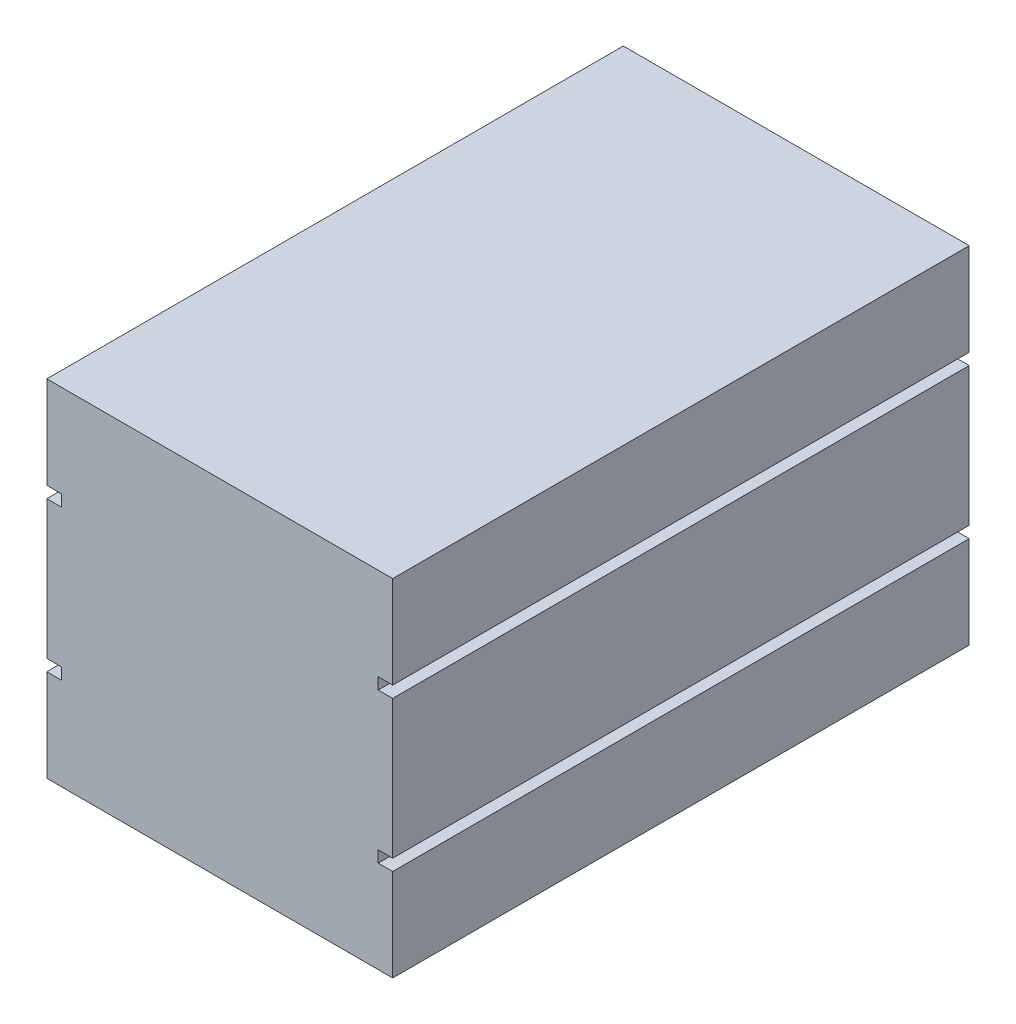
ISO-10303-21;
HEADER;
FILE_DESCRIPTION(('STEP AP214'),'2;1');
FILE_NAME('part.step','',(''),(''),'','','');
FILE_SCHEMA(('AUTOMOTIVE_DESIGN { 1 0 10303 214 1 1 1 1 }'));
ENDSEC;
DATA;
#1=APPLICATION_CONTEXT('core data for automotive mechanical design processes');
#2=APPLICATION_PROTOCOL_DEFINITION('international standard','automotive_design',2000,#1);
#3=PRODUCT_CONTEXT('',#1,'mechanical');
#4=PRODUCT('Part','Part','',(#3));
#5=PRODUCT_RELATED_PRODUCT_CATEGORY('part','',(#4));
#6=PRODUCT_DEFINITION_FORMATION('','',#4);
#7=PRODUCT_DEFINITION_CONTEXT('part definition',#1,'design');
#8=PRODUCT_DEFINITION('design','',#6,#7);
#9=PRODUCT_DEFINITION_SHAPE('','',#8);
#10=(LENGTH_UNIT() NAMED_UNIT(*) SI_UNIT(.MILLI.,.METRE.));
#11=(NAMED_UNIT(*) PLANE_ANGLE_UNIT() SI_UNIT($,.RADIAN.));
#12=(NAMED_UNIT(*) SI_UNIT($,.STERADIAN.) SOLID_ANGLE_UNIT());
#13=UNCERTAINTY_MEASURE_WITH_UNIT(LENGTH_MEASURE(1.E-05),#10,'distance_accuracy_value','');
#14=(GEOMETRIC_REPRESENTATION_CONTEXT(3) GLOBAL_UNCERTAINTY_ASSIGNED_CONTEXT((#13)) GLOBAL_UNIT_ASSIGNED_CONTEXT((#10,
#11,#12)) REPRESENTATION_CONTEXT('',''));
#15=CARTESIAN_POINT('',(0.,0.,0.));
#16=DIRECTION('',(0.,0.,1.));
#17=DIRECTION('',(1.,0.,0.));
#18=AXIS2_PLACEMENT_3D('',#15,#16,#17);
#19=CARTESIAN_POINT('',(0.,0.,0.));
#20=DIRECTION('',(-1.,0.,0.));
#21=DIRECTION('',(0.,0.,1.));
#22=AXIS2_PLACEMENT_3D('',#19,#20,#21);
#23=PLANE('',#22);
#24=DIRECTION('',(0.,0.,-1.));
#25=VECTOR('',#24,1.);
#26=CARTESIAN_POINT('',(0.,7.,25.));
#27=LINE('',#26,#25);
#28=CARTESIAN_POINT('',(0.,7.,25.));
#29=VERTEX_POINT('',#28);
#30=CARTESIAN_POINT('',(0.,7.,-25.));
#31=VERTEX_POINT('',#30);
#32=EDGE_CURVE('E200',#29,#31,#27,.T.);
#33=ORIENTED_EDGE('',*,*,#32,.F.);
#34=DIRECTION('',(0.,-1.,0.));
#35=VECTOR('',#34,1.);
#36=CARTESIAN_POINT('',(0.,-15.,25.));
#37=LINE('',#36,#35);
#38=CARTESIAN_POINT('',(0.,15.,25.));
#39=VERTEX_POINT('',#38);
#40=EDGE_CURVE('E191',#39,#29,#37,.T.);
#41=ORIENTED_EDGE('',*,*,#40,.F.);
#42=DIRECTION('',(0.,0.,1.));
#43=VECTOR('',#42,1.);
#44=CARTESIAN_POINT('',(0.,15.,25.));
#45=LINE('',#44,#43);
#46=CARTESIAN_POINT('',(0.,15.,-25.));
#47=VERTEX_POINT('',#46);
#48=EDGE_CURVE('E308',#47,#39,#45,.T.);
#49=ORIENTED_EDGE('',*,*,#48,.F.);
#50=DIRECTION('',(0.,1.,0.));
#51=VECTOR('',#50,1.);
#52=CARTESIAN_POINT('',(0.,-15.,-25.));
#53=LINE('',#52,#51);
#54=EDGE_CURVE('E287',#31,#47,#53,.T.);
#55=ORIENTED_EDGE('',*,*,#54,.F.);
#56=EDGE_LOOP('',(#33,#41,#49,#55));
#57=FACE_BOUND('',#56,.T.);
#58=ADVANCED_FACE('F33',(#57),#23,.T.);
#59=DIRECTION('',(0.,0.,-1.));
#60=VECTOR('',#59,1.);
#61=CARTESIAN_POINT('',(0.,6.,25.));
#62=LINE('',#61,#60);
#63=CARTESIAN_POINT('',(0.,6.,25.));
#64=VERTEX_POINT('',#63);
#65=CARTESIAN_POINT('',(0.,6.,-25.));
#66=VERTEX_POINT('',#65);
#67=EDGE_CURVE('E203',#64,#66,#62,.T.);
#68=ORIENTED_EDGE('',*,*,#67,.T.);
#69=CARTESIAN_POINT('',(0.,-6.,-25.));
#70=VERTEX_POINT('',#69);
#71=EDGE_CURVE('E309',#70,#66,#53,.T.);
#72=ORIENTED_EDGE('',*,*,#71,.F.);
#73=DIRECTION('',(0.,0.,-1.));
#74=VECTOR('',#73,1.);
#75=CARTESIAN_POINT('',(0.,-6.,25.));
#76=LINE('',#75,#74);
#77=CARTESIAN_POINT('',(0.,-6.,25.));
#78=VERTEX_POINT('',#77);
#79=EDGE_CURVE('E223',#78,#70,#76,.T.);
#80=ORIENTED_EDGE('',*,*,#79,.F.);
#81=EDGE_CURVE('E314',#64,#78,#37,.T.);
#82=ORIENTED_EDGE('',*,*,#81,.F.);
#83=EDGE_LOOP('',(#68,#72,#80,#82));
#84=FACE_BOUND('',#83,.T.);
#85=ADVANCED_FACE('F336',(#84),#23,.T.);
#86=CARTESIAN_POINT('',(30.,0.,0.));
#87=DIRECTION('',(-1.,0.,0.));
#88=DIRECTION('',(0.,0.,1.));
#89=AXIS2_PLACEMENT_3D('',#86,#87,#88);
#90=PLANE('',#89);
#91=DIRECTION('',(0.,-1.,0.));
#92=VECTOR('',#91,1.);
#93=CARTESIAN_POINT('',(30.,-15.,25.));
#94=LINE('',#93,#92);
#95=CARTESIAN_POINT('',(30.,6.,25.));
#96=VERTEX_POINT('',#95);
#97=CARTESIAN_POINT('',(30.,-6.,25.));
#98=VERTEX_POINT('',#97);
#99=EDGE_CURVE('E302',#96,#98,#94,.T.);
#100=ORIENTED_EDGE('',*,*,#99,.T.);
#101=DIRECTION('',(0.,0.,-1.));
#102=VECTOR('',#101,1.);
#103=CARTESIAN_POINT('',(30.,-6.,25.));
#104=LINE('',#103,#102);
#105=CARTESIAN_POINT('',(30.,-6.,-25.));
#106=VERTEX_POINT('',#105);
#107=EDGE_CURVE('E248',#98,#106,#104,.T.);
#108=ORIENTED_EDGE('',*,*,#107,.T.);
#109=DIRECTION('',(0.,1.,0.));
#110=VECTOR('',#109,1.);
#111=CARTESIAN_POINT('',(30.,-15.,-25.));
#112=LINE('',#111,#110);
#113=CARTESIAN_POINT('',(30.,6.,-25.));
#114=VERTEX_POINT('',#113);
#115=EDGE_CURVE('E294',#106,#114,#112,.T.);
#116=ORIENTED_EDGE('',*,*,#115,.T.);
#117=DIRECTION('',(0.,0.,-1.));
#118=VECTOR('',#117,1.);
#119=CARTESIAN_POINT('',(30.,6.,25.));
#120=LINE('',#119,#118);
#121=EDGE_CURVE('E267',#96,#114,#120,.T.);
#122=ORIENTED_EDGE('',*,*,#121,.F.);
#123=EDGE_LOOP('',(#100,#108,#116,#122));
#124=FACE_BOUND('',#123,.T.);
#125=ADVANCED_FACE('F362',(#124),#90,.F.);
#126=CARTESIAN_POINT('',(30.,15.,25.));
#127=VERTEX_POINT('',#126);
#128=CARTESIAN_POINT('',(30.,7.,25.));
#129=VERTEX_POINT('',#128);
#130=EDGE_CURVE('E298',#127,#129,#94,.T.);
#131=ORIENTED_EDGE('',*,*,#130,.T.);
#132=DIRECTION('',(0.,0.,-1.));
#133=VECTOR('',#132,1.);
#134=CARTESIAN_POINT('',(30.,7.,25.));
#135=LINE('',#134,#133);
#136=CARTESIAN_POINT('',(30.,7.,-25.));
#137=VERTEX_POINT('',#136);
#138=EDGE_CURVE('E274',#129,#137,#135,.T.);
#139=ORIENTED_EDGE('',*,*,#138,.T.);
#140=CARTESIAN_POINT('',(30.,15.,-25.));
#141=VERTEX_POINT('',#140);
#142=EDGE_CURVE('E295',#137,#141,#112,.T.);
#143=ORIENTED_EDGE('',*,*,#142,.T.);
#144=DIRECTION('',(0.,0.,1.));
#145=VECTOR('',#144,1.);
#146=CARTESIAN_POINT('',(30.,15.,25.));
#147=LINE('',#146,#145);
#148=EDGE_CURVE('E293',#141,#127,#147,.T.);
#149=ORIENTED_EDGE('',*,*,#148,.T.);
#150=EDGE_LOOP('',(#131,#139,#143,#149));
#151=FACE_BOUND('',#150,.T.);
#152=ADVANCED_FACE('F373',(#151),#90,.F.);
#153=CARTESIAN_POINT('',(30.,-15.,-25.));
#154=DIRECTION('',(0.,0.,1.));
#155=DIRECTION('',(1.,0.,0.));
#156=AXIS2_PLACEMENT_3D('',#153,#154,#155);
#157=PLANE('',#156);
#158=CARTESIAN_POINT('',(15.,0.,-25.));
#159=DIRECTION('',(0.,0.,-1.));
#160=DIRECTION('',(-1.,0.,0.));
#161=AXIS2_PLACEMENT_3D('',#158,#159,#160);
#162=CIRCLE('',#161,5.93334200487304);
#163=CARTESIAN_POINT('',(9.06665799512696,0.,-25.));
#164=VERTEX_POINT('',#163);
#165=EDGE_CURVE('E277',#164,#164,#162,.T.);
#166=ORIENTED_EDGE('',*,*,#165,.F.);
#167=EDGE_LOOP('',(#166));
#168=FACE_BOUND('',#167,.T.);
#169=DIRECTION('',(0.,-1.,0.));
#170=VECTOR('',#169,1.);
#171=CARTESIAN_POINT('',(1.25496537556247,7.,-25.));
#172=LINE('',#171,#170);
#173=CARTESIAN_POINT('',(1.25496537556247,7.,-25.));
#174=VERTEX_POINT('',#173);
#175=CARTESIAN_POINT('',(1.25496537556247,6.,-25.));
#176=VERTEX_POINT('',#175);
#177=EDGE_CURVE('E194',#174,#176,#172,.T.);
#178=ORIENTED_EDGE('',*,*,#177,.F.);
#179=DIRECTION('',(1.,0.,0.));
#180=VECTOR('',#179,1.);
#181=CARTESIAN_POINT('',(0.,7.,-25.));
#182=LINE('',#181,#180);
#183=EDGE_CURVE('E176',#31,#174,#182,.T.);
#184=ORIENTED_EDGE('',*,*,#183,.F.);
#185=ORIENTED_EDGE('',*,*,#54,.T.);
#186=DIRECTION('',(-1.,0.,0.));
#187=VECTOR('',#186,1.);
#188=CARTESIAN_POINT('',(30.,15.,-25.));
#189=LINE('',#188,#187);
#190=EDGE_CURVE('E11',#141,#47,#189,.T.);
#191=ORIENTED_EDGE('',*,*,#190,.F.);
#192=ORIENTED_EDGE('',*,*,#142,.F.);
#193=DIRECTION('',(1.,0.,0.));
#194=VECTOR('',#193,1.);
#195=CARTESIAN_POINT('',(30.,7.,-25.));
#196=LINE('',#195,#194);
#197=CARTESIAN_POINT('',(28.7450346244375,7.,-25.));
#198=VERTEX_POINT('',#197);
#199=EDGE_CURVE('E261',#198,#137,#196,.T.);
#200=ORIENTED_EDGE('',*,*,#199,.F.);
#201=DIRECTION('',(0.,1.,0.));
#202=VECTOR('',#201,1.);
#203=CARTESIAN_POINT('',(28.7450346244375,7.,-25.));
#204=LINE('',#203,#202);
#205=CARTESIAN_POINT('',(28.7450346244375,6.,-25.));
#206=VERTEX_POINT('',#205);
#207=EDGE_CURVE('E270',#206,#198,#204,.T.);
#208=ORIENTED_EDGE('',*,*,#207,.F.);
#209=DIRECTION('',(-1.,0.,0.));
#210=VECTOR('',#209,1.);
#211=CARTESIAN_POINT('',(30.,6.,-25.));
#212=LINE('',#211,#210);
#213=EDGE_CURVE('E251',#114,#206,#212,.T.);
#214=ORIENTED_EDGE('',*,*,#213,.F.);
#215=ORIENTED_EDGE('',*,*,#115,.F.);
#216=DIRECTION('',(1.,0.,0.));
#217=VECTOR('',#216,1.);
#218=CARTESIAN_POINT('',(30.,-6.,-25.));
#219=LINE('',#218,#217);
#220=CARTESIAN_POINT('',(28.7450346244375,-6.,-25.));
#221=VERTEX_POINT('',#220);
#222=EDGE_CURVE('E235',#221,#106,#219,.T.);
#223=ORIENTED_EDGE('',*,*,#222,.F.);
#224=DIRECTION('',(0.,1.,0.));
#225=VECTOR('',#224,1.);
#226=CARTESIAN_POINT('',(28.7450346244375,-6.,-25.));
#227=LINE('',#226,#225);
#228=CARTESIAN_POINT('',(28.7450346244375,-7.,-25.));
#229=VERTEX_POINT('',#228);
#230=EDGE_CURVE('E244',#229,#221,#227,.T.);
#231=ORIENTED_EDGE('',*,*,#230,.F.);
#232=DIRECTION('',(-1.,0.,0.));
#233=VECTOR('',#232,1.);
#234=CARTESIAN_POINT('',(30.,-7.,-25.));
#235=LINE('',#234,#233);
#236=CARTESIAN_POINT('',(30.,-7.,-25.));
#237=VERTEX_POINT('',#236);
#238=EDGE_CURVE('E225',#237,#229,#235,.T.);
#239=ORIENTED_EDGE('',*,*,#238,.F.);
#240=CARTESIAN_POINT('',(30.,-15.,-25.));
#241=VERTEX_POINT('',#240);
#242=EDGE_CURVE('E290',#241,#237,#112,.T.);
#243=ORIENTED_EDGE('',*,*,#242,.F.);
#244=DIRECTION('',(-1.,0.,0.));
#245=VECTOR('',#244,1.);
#246=CARTESIAN_POINT('',(30.,-15.,-25.));
#247=LINE('',#246,#245);
#248=CARTESIAN_POINT('',(0.,-15.,-25.));
#249=VERTEX_POINT('',#248);
#250=EDGE_CURVE('E304',#241,#249,#247,.T.);
#251=ORIENTED_EDGE('',*,*,#250,.T.);
#252=CARTESIAN_POINT('',(0.,-7.,-25.));
#253=VERTEX_POINT('',#252);
#254=EDGE_CURVE('E305',#249,#253,#53,.T.);
#255=ORIENTED_EDGE('',*,*,#254,.T.);
#256=DIRECTION('',(-1.,0.,0.));
#257=VECTOR('',#256,1.);
#258=CARTESIAN_POINT('',(0.,-7.,-25.));
#259=LINE('',#258,#257);
#260=CARTESIAN_POINT('',(1.25496537556247,-7.,-25.));
#261=VERTEX_POINT('',#260);
#262=EDGE_CURVE('E56',#261,#253,#259,.T.);
#263=ORIENTED_EDGE('',*,*,#262,.F.);
#264=DIRECTION('',(0.,-1.,0.));
#265=VECTOR('',#264,1.);
#266=CARTESIAN_POINT('',(1.25496537556247,-6.,-25.));
#267=LINE('',#266,#265);
#268=CARTESIAN_POINT('',(1.25496537556247,-6.,-25.));
#269=VERTEX_POINT('',#268);
#270=EDGE_CURVE('E219',#269,#261,#267,.T.);
#271=ORIENTED_EDGE('',*,*,#270,.F.);
#272=DIRECTION('',(1.,0.,0.));
#273=VECTOR('',#272,1.);
#274=CARTESIAN_POINT('',(0.,-6.,-25.));
#275=LINE('',#274,#273);
#276=EDGE_CURVE('E202',#70,#269,#275,.T.);
#277=ORIENTED_EDGE('',*,*,#276,.F.);
#278=ORIENTED_EDGE('',*,*,#71,.T.);
#279=DIRECTION('',(-1.,0.,0.));
#280=VECTOR('',#279,1.);
#281=CARTESIAN_POINT('',(0.,6.,-25.));
#282=LINE('',#281,#280);
#283=EDGE_CURVE('E192',#176,#66,#282,.T.);
#284=ORIENTED_EDGE('',*,*,#283,.F.);
#285=EDGE_LOOP('',(#178,#184,#185,#191,#192,#200,#208,#214,#215,#223,#231,#239,#243,#251,#255,
#263,#271,#277,#278,#284));
#286=FACE_BOUND('',#285,.T.);
#287=ADVANCED_FACE('F35',(#168,#286),#157,.F.);
#288=CARTESIAN_POINT('',(30.,15.,25.));
#289=DIRECTION('',(0.,-1.,0.));
#290=DIRECTION('',(0.,0.,-1.));
#291=AXIS2_PLACEMENT_3D('',#288,#289,#290);
#292=PLANE('',#291);
#293=ORIENTED_EDGE('',*,*,#48,.T.);
#294=DIRECTION('',(-1.,0.,0.));
#295=VECTOR('',#294,1.);
#296=CARTESIAN_POINT('',(30.,15.,25.));
#297=LINE('',#296,#295);
#298=EDGE_CURVE('E41',#127,#39,#297,.T.);
#299=ORIENTED_EDGE('',*,*,#298,.F.);
#300=ORIENTED_EDGE('',*,*,#148,.F.);
#301=ORIENTED_EDGE('',*,*,#190,.T.);
#302=EDGE_LOOP('',(#293,#299,#300,#301));
#303=FACE_BOUND('',#302,.T.);
#304=ADVANCED_FACE('F375',(#303),#292,.F.);
#305=CARTESIAN_POINT('',(30.,-15.,25.));
#306=DIRECTION('',(0.,0.,-1.));
#307=DIRECTION('',(-1.,0.,0.));
#308=AXIS2_PLACEMENT_3D('',#305,#306,#307);
#309=PLANE('',#308);
#310=ORIENTED_EDGE('',*,*,#40,.T.);
#311=DIRECTION('',(1.,0.,0.));
#312=VECTOR('',#311,1.);
#313=CARTESIAN_POINT('',(0.,7.,25.));
#314=LINE('',#313,#312);
#315=CARTESIAN_POINT('',(1.25496537556247,7.,25.));
#316=VERTEX_POINT('',#315);
#317=EDGE_CURVE('E173',#29,#316,#314,.T.);
#318=ORIENTED_EDGE('',*,*,#317,.T.);
#319=DIRECTION('',(0.,-1.,0.));
#320=VECTOR('',#319,1.);
#321=CARTESIAN_POINT('',(1.25496537556247,7.,25.));
#322=LINE('',#321,#320);
#323=CARTESIAN_POINT('',(1.25496537556247,6.,25.));
#324=VERTEX_POINT('',#323);
#325=EDGE_CURVE('E183',#316,#324,#322,.T.);
#326=ORIENTED_EDGE('',*,*,#325,.T.);
#327=DIRECTION('',(-1.,0.,0.));
#328=VECTOR('',#327,1.);
#329=CARTESIAN_POINT('',(0.,6.,25.));
#330=LINE('',#329,#328);
#331=EDGE_CURVE('E48',#324,#64,#330,.T.);
#332=ORIENTED_EDGE('',*,*,#331,.T.);
#333=ORIENTED_EDGE('',*,*,#81,.T.);
#334=DIRECTION('',(1.,0.,0.));
#335=VECTOR('',#334,1.);
#336=CARTESIAN_POINT('',(0.,-6.,25.));
#337=LINE('',#336,#335);
#338=CARTESIAN_POINT('',(1.25496537556247,-6.,25.));
#339=VERTEX_POINT('',#338);
#340=EDGE_CURVE('E207',#78,#339,#337,.T.);
#341=ORIENTED_EDGE('',*,*,#340,.T.);
#342=DIRECTION('',(0.,-1.,0.));
#343=VECTOR('',#342,1.);
#344=CARTESIAN_POINT('',(1.25496537556247,-6.,25.));
#345=LINE('',#344,#343);
#346=CARTESIAN_POINT('',(1.25496537556247,-7.,25.));
#347=VERTEX_POINT('',#346);
#348=EDGE_CURVE('E210',#339,#347,#345,.T.);
#349=ORIENTED_EDGE('',*,*,#348,.T.);
#350=DIRECTION('',(-1.,0.,0.));
#351=VECTOR('',#350,1.);
#352=CARTESIAN_POINT('',(0.,-7.,25.));
#353=LINE('',#352,#351);
#354=CARTESIAN_POINT('',(0.,-7.,25.));
#355=VERTEX_POINT('',#354);
#356=EDGE_CURVE('E213',#347,#355,#353,.T.);
#357=ORIENTED_EDGE('',*,*,#356,.T.);
#358=CARTESIAN_POINT('',(0.,-15.,25.));
#359=VERTEX_POINT('',#358);
#360=EDGE_CURVE('E311',#355,#359,#37,.T.);
#361=ORIENTED_EDGE('',*,*,#360,.T.);
#362=DIRECTION('',(-1.,0.,0.));
#363=VECTOR('',#362,1.);
#364=CARTESIAN_POINT('',(30.,-15.,25.));
#365=LINE('',#364,#363);
#366=CARTESIAN_POINT('',(30.,-15.,25.));
#367=VERTEX_POINT('',#366);
#368=EDGE_CURVE('E318',#367,#359,#365,.T.);
#369=ORIENTED_EDGE('',*,*,#368,.F.);
#370=CARTESIAN_POINT('',(30.,-7.,25.));
#371=VERTEX_POINT('',#370);
#372=EDGE_CURVE('E297',#371,#367,#94,.T.);
#373=ORIENTED_EDGE('',*,*,#372,.F.);
#374=DIRECTION('',(-1.,0.,0.));
#375=VECTOR('',#374,1.);
#376=CARTESIAN_POINT('',(30.,-7.,25.));
#377=LINE('',#376,#375);
#378=CARTESIAN_POINT('',(28.7450346244375,-7.,25.));
#379=VERTEX_POINT('',#378);
#380=EDGE_CURVE('E231',#371,#379,#377,.T.);
#381=ORIENTED_EDGE('',*,*,#380,.T.);
#382=DIRECTION('',(0.,1.,0.));
#383=VECTOR('',#382,1.);
#384=CARTESIAN_POINT('',(28.7450346244375,-6.,25.));
#385=LINE('',#384,#383);
#386=CARTESIAN_POINT('',(28.7450346244375,-6.,25.));
#387=VERTEX_POINT('',#386);
#388=EDGE_CURVE('E234',#379,#387,#385,.T.);
#389=ORIENTED_EDGE('',*,*,#388,.T.);
#390=DIRECTION('',(1.,0.,0.));
#391=VECTOR('',#390,1.);
#392=CARTESIAN_POINT('',(30.,-6.,25.));
#393=LINE('',#392,#391);
#394=EDGE_CURVE('E238',#387,#98,#393,.T.);
#395=ORIENTED_EDGE('',*,*,#394,.T.);
#396=ORIENTED_EDGE('',*,*,#99,.F.);
#397=DIRECTION('',(-1.,0.,0.));
#398=VECTOR('',#397,1.);
#399=CARTESIAN_POINT('',(30.,6.,25.));
#400=LINE('',#399,#398);
#401=CARTESIAN_POINT('',(28.7450346244375,6.,25.));
#402=VERTEX_POINT('',#401);
#403=EDGE_CURVE('E257',#96,#402,#400,.T.);
#404=ORIENTED_EDGE('',*,*,#403,.T.);
#405=DIRECTION('',(0.,1.,0.));
#406=VECTOR('',#405,1.);
#407=CARTESIAN_POINT('',(28.7450346244375,7.,25.));
#408=LINE('',#407,#406);
#409=CARTESIAN_POINT('',(28.7450346244375,7.,25.));
#410=VERTEX_POINT('',#409);
#411=EDGE_CURVE('E260',#402,#410,#408,.T.);
#412=ORIENTED_EDGE('',*,*,#411,.T.);
#413=DIRECTION('',(1.,0.,0.));
#414=VECTOR('',#413,1.);
#415=CARTESIAN_POINT('',(30.,7.,25.));
#416=LINE('',#415,#414);
#417=EDGE_CURVE('E264',#410,#129,#416,.T.);
#418=ORIENTED_EDGE('',*,*,#417,.T.);
#419=ORIENTED_EDGE('',*,*,#130,.F.);
#420=ORIENTED_EDGE('',*,*,#298,.T.);
#421=EDGE_LOOP('',(#310,#318,#326,#332,#333,#341,#349,#357,#361,#369,#373,#381,#389,#395,#396,
#404,#412,#418,#419,#420));
#422=FACE_BOUND('',#421,.T.);
#423=ADVANCED_FACE('F188',(#422),#309,.F.);
#424=CARTESIAN_POINT('',(30.,-15.,25.));
#425=DIRECTION('',(0.,1.,0.));
#426=DIRECTION('',(0.,0.,1.));
#427=AXIS2_PLACEMENT_3D('',#424,#425,#426);
#428=PLANE('',#427);
#429=DIRECTION('',(0.,0.,-1.));
#430=VECTOR('',#429,1.);
#431=CARTESIAN_POINT('',(0.,-15.,25.));
#432=LINE('',#431,#430);
#433=EDGE_CURVE('E313',#359,#249,#432,.T.);
#434=ORIENTED_EDGE('',*,*,#433,.T.);
#435=ORIENTED_EDGE('',*,*,#250,.F.);
#436=DIRECTION('',(0.,0.,-1.));
#437=VECTOR('',#436,1.);
#438=CARTESIAN_POINT('',(30.,-15.,25.));
#439=LINE('',#438,#437);
#440=EDGE_CURVE('E301',#367,#241,#439,.T.);
#441=ORIENTED_EDGE('',*,*,#440,.F.);
#442=ORIENTED_EDGE('',*,*,#368,.T.);
#443=EDGE_LOOP('',(#434,#435,#441,#442));
#444=FACE_BOUND('',#443,.T.);
#445=ADVANCED_FACE('F347',(#444),#428,.F.);
#446=ORIENTED_EDGE('',*,*,#242,.T.);
#447=DIRECTION('',(0.,0.,-1.));
#448=VECTOR('',#447,1.);
#449=CARTESIAN_POINT('',(30.,-7.,25.));
#450=LINE('',#449,#448);
#451=EDGE_CURVE('E241',#371,#237,#450,.T.);
#452=ORIENTED_EDGE('',*,*,#451,.F.);
#453=ORIENTED_EDGE('',*,*,#372,.T.);
#454=ORIENTED_EDGE('',*,*,#440,.T.);
#455=EDGE_LOOP('',(#446,#452,#453,#454));
#456=FACE_BOUND('',#455,.T.);
#457=ADVANCED_FACE('F357',(#456),#90,.F.);
#458=DIRECTION('',(0.,0.,-1.));
#459=VECTOR('',#458,1.);
#460=CARTESIAN_POINT('',(0.,-7.,25.));
#461=LINE('',#460,#459);
#462=EDGE_CURVE('E226',#355,#253,#461,.T.);
#463=ORIENTED_EDGE('',*,*,#462,.T.);
#464=ORIENTED_EDGE('',*,*,#254,.F.);
#465=ORIENTED_EDGE('',*,*,#433,.F.);
#466=ORIENTED_EDGE('',*,*,#360,.F.);
#467=EDGE_LOOP('',(#463,#464,#465,#466));
#468=FACE_BOUND('',#467,.T.);
#469=ADVANCED_FACE('F350',(#468),#23,.T.);
#470=CARTESIAN_POINT('',(15.,0.,15.));
#471=DIRECTION('',(0.,0.,-1.));
#472=DIRECTION('',(-1.,0.,0.));
#473=AXIS2_PLACEMENT_3D('',#470,#471,#472);
#474=CYLINDRICAL_SURFACE('',#473,5.93334200487304);
#475=CARTESIAN_POINT('',(15.,0.,15.));
#476=DIRECTION('',(0.,0.,-1.));
#477=DIRECTION('',(-1.,0.,0.));
#478=AXIS2_PLACEMENT_3D('',#475,#476,#477);
#479=CIRCLE('',#478,5.93334200487304);
#480=CARTESIAN_POINT('',(9.06665799512696,0.,15.));
#481=VERTEX_POINT('',#480);
#482=EDGE_CURVE('E284',#481,#481,#479,.T.);
#483=ORIENTED_EDGE('',*,*,#482,.F.);
#484=EDGE_LOOP('',(#483));
#485=FACE_BOUND('',#484,.T.);
#486=ORIENTED_EDGE('',*,*,#165,.T.);
#487=EDGE_LOOP('',(#486));
#488=FACE_BOUND('',#487,.T.);
#489=ADVANCED_FACE('F391',(#485,#488),#474,.F.);
#490=CARTESIAN_POINT('',(15.,0.,15.));
#491=DIRECTION('',(0.,0.,-1.));
#492=DIRECTION('',(-1.,0.,0.));
#493=AXIS2_PLACEMENT_3D('',#490,#491,#492);
#494=PLANE('',#493);
#495=ORIENTED_EDGE('',*,*,#482,.T.);
#496=EDGE_LOOP('',(#495));
#497=FACE_BOUND('',#496,.T.);
#498=ADVANCED_FACE('F396',(#497),#494,.T.);
#499=CARTESIAN_POINT('',(30.,7.,25.));
#500=DIRECTION('',(0.,1.,0.));
#501=DIRECTION('',(0.,0.,1.));
#502=AXIS2_PLACEMENT_3D('',#499,#500,#501);
#503=PLANE('',#502);
#504=ORIENTED_EDGE('',*,*,#199,.T.);
#505=ORIENTED_EDGE('',*,*,#138,.F.);
#506=ORIENTED_EDGE('',*,*,#417,.F.);
#507=DIRECTION('',(0.,0.,-1.));
#508=VECTOR('',#507,1.);
#509=CARTESIAN_POINT('',(28.7450346244375,7.,25.));
#510=LINE('',#509,#508);
#511=EDGE_CURVE('E278',#410,#198,#510,.T.);
#512=ORIENTED_EDGE('',*,*,#511,.T.);
#513=EDGE_LOOP('',(#504,#505,#506,#512));
#514=FACE_BOUND('',#513,.T.);
#515=ADVANCED_FACE('F434',(#514),#503,.F.);
#516=CARTESIAN_POINT('',(28.7450346244375,7.,25.));
#517=DIRECTION('',(-1.,0.,0.));
#518=DIRECTION('',(0.,0.,1.));
#519=AXIS2_PLACEMENT_3D('',#516,#517,#518);
#520=PLANE('',#519);
#521=ORIENTED_EDGE('',*,*,#207,.T.);
#522=ORIENTED_EDGE('',*,*,#511,.F.);
#523=ORIENTED_EDGE('',*,*,#411,.F.);
#524=DIRECTION('',(0.,0.,-1.));
#525=VECTOR('',#524,1.);
#526=CARTESIAN_POINT('',(28.7450346244375,6.,25.));
#527=LINE('',#526,#525);
#528=EDGE_CURVE('E280',#402,#206,#527,.T.);
#529=ORIENTED_EDGE('',*,*,#528,.T.);
#530=EDGE_LOOP('',(#521,#522,#523,#529));
#531=FACE_BOUND('',#530,.T.);
#532=ADVANCED_FACE('F439',(#531),#520,.F.);
#533=CARTESIAN_POINT('',(30.,6.,25.));
#534=DIRECTION('',(0.,-1.,0.));
#535=DIRECTION('',(0.,0.,-1.));
#536=AXIS2_PLACEMENT_3D('',#533,#534,#535);
#537=PLANE('',#536);
#538=ORIENTED_EDGE('',*,*,#213,.T.);
#539=ORIENTED_EDGE('',*,*,#528,.F.);
#540=ORIENTED_EDGE('',*,*,#403,.F.);
#541=ORIENTED_EDGE('',*,*,#121,.T.);
#542=EDGE_LOOP('',(#538,#539,#540,#541));
#543=FACE_BOUND('',#542,.T.);
#544=ADVANCED_FACE('F451',(#543),#537,.F.);
#545=CARTESIAN_POINT('',(30.,-6.,25.));
#546=DIRECTION('',(0.,1.,0.));
#547=DIRECTION('',(-1.,0.,0.));
#548=AXIS2_PLACEMENT_3D('',#545,#546,#547);
#549=PLANE('',#548);
#550=ORIENTED_EDGE('',*,*,#222,.T.);
#551=ORIENTED_EDGE('',*,*,#107,.F.);
#552=ORIENTED_EDGE('',*,*,#394,.F.);
#553=DIRECTION('',(0.,0.,-1.));
#554=VECTOR('',#553,1.);
#555=CARTESIAN_POINT('',(28.7450346244375,-6.,25.));
#556=LINE('',#555,#554);
#557=EDGE_CURVE('E252',#387,#221,#556,.T.);
#558=ORIENTED_EDGE('',*,*,#557,.T.);
#559=EDGE_LOOP('',(#550,#551,#552,#558));
#560=FACE_BOUND('',#559,.T.);
#561=ADVANCED_FACE('F367',(#560),#549,.F.);
#562=CARTESIAN_POINT('',(28.7450346244375,-6.,25.));
#563=DIRECTION('',(-1.,0.,0.));
#564=DIRECTION('',(0.,0.,1.));
#565=AXIS2_PLACEMENT_3D('',#562,#563,#564);
#566=PLANE('',#565);
#567=ORIENTED_EDGE('',*,*,#230,.T.);
#568=ORIENTED_EDGE('',*,*,#557,.F.);
#569=ORIENTED_EDGE('',*,*,#388,.F.);
#570=DIRECTION('',(0.,0.,-1.));
#571=VECTOR('',#570,1.);
#572=CARTESIAN_POINT('',(28.7450346244375,-7.,25.));
#573=LINE('',#572,#571);
#574=EDGE_CURVE('E254',#379,#229,#573,.T.);
#575=ORIENTED_EDGE('',*,*,#574,.T.);
#576=EDGE_LOOP('',(#567,#568,#569,#575));
#577=FACE_BOUND('',#576,.T.);
#578=ADVANCED_FACE('F470',(#577),#566,.F.);
#579=CARTESIAN_POINT('',(30.,-7.,25.));
#580=DIRECTION('',(0.,-1.,0.));
#581=DIRECTION('',(0.,0.,-1.));
#582=AXIS2_PLACEMENT_3D('',#579,#580,#581);
#583=PLANE('',#582);
#584=ORIENTED_EDGE('',*,*,#238,.T.);
#585=ORIENTED_EDGE('',*,*,#574,.F.);
#586=ORIENTED_EDGE('',*,*,#380,.F.);
#587=ORIENTED_EDGE('',*,*,#451,.T.);
#588=EDGE_LOOP('',(#584,#585,#586,#587));
#589=FACE_BOUND('',#588,.T.);
#590=ADVANCED_FACE('F479',(#589),#583,.F.);
#591=CARTESIAN_POINT('',(0.,-6.,25.));
#592=DIRECTION('',(0.,1.,0.));
#593=DIRECTION('',(-1.,0.,0.));
#594=AXIS2_PLACEMENT_3D('',#591,#592,#593);
#595=PLANE('',#594);
#596=ORIENTED_EDGE('',*,*,#276,.T.);
#597=DIRECTION('',(0.,0.,-1.));
#598=VECTOR('',#597,1.);
#599=CARTESIAN_POINT('',(1.25496537556247,-6.,25.));
#600=LINE('',#599,#598);
#601=EDGE_CURVE('E216',#339,#269,#600,.T.);
#602=ORIENTED_EDGE('',*,*,#601,.F.);
#603=ORIENTED_EDGE('',*,*,#340,.F.);
#604=ORIENTED_EDGE('',*,*,#79,.T.);
#605=EDGE_LOOP('',(#596,#602,#603,#604));
#606=FACE_BOUND('',#605,.T.);
#607=ADVANCED_FACE('F489',(#606),#595,.F.);
#608=CARTESIAN_POINT('',(0.,-7.,25.));
#609=DIRECTION('',(0.,-1.,0.));
#610=DIRECTION('',(0.,0.,-1.));
#611=AXIS2_PLACEMENT_3D('',#608,#609,#610);
#612=PLANE('',#611);
#613=ORIENTED_EDGE('',*,*,#262,.T.);
#614=ORIENTED_EDGE('',*,*,#462,.F.);
#615=ORIENTED_EDGE('',*,*,#356,.F.);
#616=DIRECTION('',(0.,0.,-1.));
#617=VECTOR('',#616,1.);
#618=CARTESIAN_POINT('',(1.25496537556247,-7.,25.));
#619=LINE('',#618,#617);
#620=EDGE_CURVE('E228',#347,#261,#619,.T.);
#621=ORIENTED_EDGE('',*,*,#620,.T.);
#622=EDGE_LOOP('',(#613,#614,#615,#621));
#623=FACE_BOUND('',#622,.T.);
#624=ADVANCED_FACE('F499',(#623),#612,.F.);
#625=CARTESIAN_POINT('',(1.25496537556247,-6.,25.));
#626=DIRECTION('',(1.,0.,0.));
#627=DIRECTION('',(0.,0.,-1.));
#628=AXIS2_PLACEMENT_3D('',#625,#626,#627);
#629=PLANE('',#628);
#630=ORIENTED_EDGE('',*,*,#270,.T.);
#631=ORIENTED_EDGE('',*,*,#620,.F.);
#632=ORIENTED_EDGE('',*,*,#348,.F.);
#633=ORIENTED_EDGE('',*,*,#601,.T.);
#634=EDGE_LOOP('',(#630,#631,#632,#633));
#635=FACE_BOUND('',#634,.T.);
#636=ADVANCED_FACE('F509',(#635),#629,.F.);
#637=CARTESIAN_POINT('',(0.,7.,25.));
#638=DIRECTION('',(0.,1.,0.));
#639=DIRECTION('',(0.,0.,1.));
#640=AXIS2_PLACEMENT_3D('',#637,#638,#639);
#641=PLANE('',#640);
#642=ORIENTED_EDGE('',*,*,#183,.T.);
#643=DIRECTION('',(0.,0.,-1.));
#644=VECTOR('',#643,1.);
#645=CARTESIAN_POINT('',(1.25496537556247,7.,25.));
#646=LINE('',#645,#644);
#647=EDGE_CURVE('E169',#316,#174,#646,.T.);
#648=ORIENTED_EDGE('',*,*,#647,.F.);
#649=ORIENTED_EDGE('',*,*,#317,.F.);
#650=ORIENTED_EDGE('',*,*,#32,.T.);
#651=EDGE_LOOP('',(#642,#648,#649,#650));
#652=FACE_BOUND('',#651,.T.);
#653=ADVANCED_FACE('F171',(#652),#641,.F.);
#654=CARTESIAN_POINT('',(0.,6.,25.));
#655=DIRECTION('',(0.,-1.,0.));
#656=DIRECTION('',(0.,0.,-1.));
#657=AXIS2_PLACEMENT_3D('',#654,#655,#656);
#658=PLANE('',#657);
#659=ORIENTED_EDGE('',*,*,#283,.T.);
#660=ORIENTED_EDGE('',*,*,#67,.F.);
#661=ORIENTED_EDGE('',*,*,#331,.F.);
#662=DIRECTION('',(0.,0.,-1.));
#663=VECTOR('',#662,1.);
#664=CARTESIAN_POINT('',(1.25496537556247,6.,25.));
#665=LINE('',#664,#663);
#666=EDGE_CURVE('E180',#324,#176,#665,.T.);
#667=ORIENTED_EDGE('',*,*,#666,.T.);
#668=EDGE_LOOP('',(#659,#660,#661,#667));
#669=FACE_BOUND('',#668,.T.);
#670=ADVANCED_FACE('F333',(#669),#658,.F.);
#671=CARTESIAN_POINT('',(1.25496537556247,7.,25.));
#672=DIRECTION('',(1.,0.,0.));
#673=DIRECTION('',(0.,0.,-1.));
#674=AXIS2_PLACEMENT_3D('',#671,#672,#673);
#675=PLANE('',#674);
#676=ORIENTED_EDGE('',*,*,#177,.T.);
#677=ORIENTED_EDGE('',*,*,#666,.F.);
#678=ORIENTED_EDGE('',*,*,#325,.F.);
#679=ORIENTED_EDGE('',*,*,#647,.T.);
#680=EDGE_LOOP('',(#676,#677,#678,#679));
#681=FACE_BOUND('',#680,.T.);
#682=ADVANCED_FACE('F184',(#681),#675,.F.);
#683=CLOSED_SHELL('',(#58,#85,#125,#152,#287,#304,#423,#445,#457,#469,#489,#498,#515,#532,#544,
#561,#578,#590,#607,#624,#636,#653,#670,#682));
#684=MANIFOLD_SOLID_BREP('B2',#683);
#685=ADVANCED_BREP_SHAPE_REPRESENTATION('',(#18,#684),#14);
#686=SHAPE_DEFINITION_REPRESENTATION(#9,#685);
ENDSEC;
END-ISO-10303-21;
